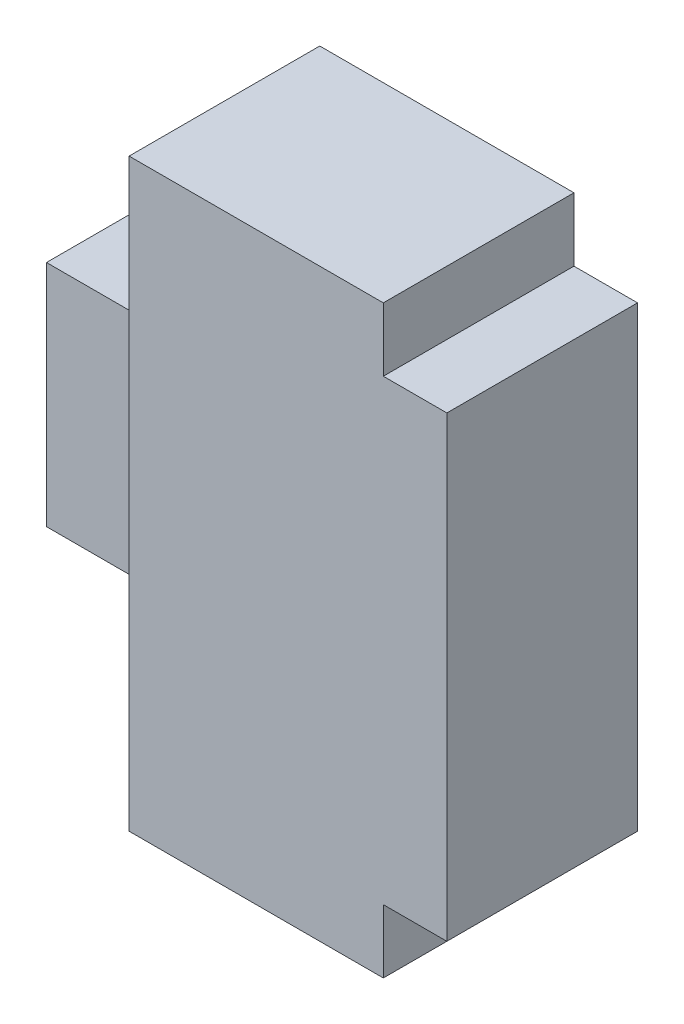
ISO-10303-21;
HEADER;
FILE_DESCRIPTION(('STEP AP214'),'2;1');
FILE_NAME('part.step','',(''),(''),'','','');
FILE_SCHEMA(('AUTOMOTIVE_DESIGN { 1 0 10303 214 1 1 1 1 }'));
ENDSEC;
DATA;
#1=APPLICATION_CONTEXT('core data for automotive mechanical design processes');
#2=APPLICATION_PROTOCOL_DEFINITION('international standard','automotive_design',2000,#1);
#3=PRODUCT_CONTEXT('',#1,'mechanical');
#4=PRODUCT('Part','Part','',(#3));
#5=PRODUCT_RELATED_PRODUCT_CATEGORY('part','',(#4));
#6=PRODUCT_DEFINITION_FORMATION('','',#4);
#7=PRODUCT_DEFINITION_CONTEXT('part definition',#1,'design');
#8=PRODUCT_DEFINITION('design','',#6,#7);
#9=PRODUCT_DEFINITION_SHAPE('','',#8);
#10=(LENGTH_UNIT() NAMED_UNIT(*) SI_UNIT(.MILLI.,.METRE.));
#11=(NAMED_UNIT(*) PLANE_ANGLE_UNIT() SI_UNIT($,.RADIAN.));
#12=(NAMED_UNIT(*) SI_UNIT($,.STERADIAN.) SOLID_ANGLE_UNIT());
#13=UNCERTAINTY_MEASURE_WITH_UNIT(LENGTH_MEASURE(1.E-05),#10,'distance_accuracy_value','');
#14=(GEOMETRIC_REPRESENTATION_CONTEXT(3) GLOBAL_UNCERTAINTY_ASSIGNED_CONTEXT((#13)) GLOBAL_UNIT_ASSIGNED_CONTEXT((#10,
#11,#12)) REPRESENTATION_CONTEXT('',''));
#15=CARTESIAN_POINT('',(0.,0.,0.));
#16=DIRECTION('',(0.,0.,1.));
#17=DIRECTION('',(1.,0.,0.));
#18=AXIS2_PLACEMENT_3D('',#15,#16,#17);
#19=CARTESIAN_POINT('',(-2.25,0.9,0.4));
#20=DIRECTION('',(-1.,0.,0.));
#21=DIRECTION('',(0.,0.,1.));
#22=AXIS2_PLACEMENT_3D('',#19,#20,#21);
#23=PLANE('',#22);
#24=DIRECTION('',(0.,0.,-1.));
#25=VECTOR('',#24,1.);
#26=CARTESIAN_POINT('',(-2.25,-0.9,0.4));
#27=LINE('',#26,#25);
#28=CARTESIAN_POINT('',(-2.25,-0.9,0.4));
#29=VERTEX_POINT('',#28);
#30=CARTESIAN_POINT('',(-2.25,-0.9,-0.4));
#31=VERTEX_POINT('',#30);
#32=EDGE_CURVE('E146',#29,#31,#27,.T.);
#33=ORIENTED_EDGE('',*,*,#32,.F.);
#34=DIRECTION('',(0.,1.,0.));
#35=VECTOR('',#34,1.);
#36=CARTESIAN_POINT('',(-2.25,0.9,0.4));
#37=LINE('',#36,#35);
#38=CARTESIAN_POINT('',(-2.25,0.9,0.4));
#39=VERTEX_POINT('',#38);
#40=EDGE_CURVE('E152',#39,#29,#37,.F.);
#41=ORIENTED_EDGE('',*,*,#40,.F.);
#42=DIRECTION('',(0.,0.,1.));
#43=VECTOR('',#42,1.);
#44=CARTESIAN_POINT('',(-2.25,0.9,0.4));
#45=LINE('',#44,#43);
#46=CARTESIAN_POINT('',(-2.25,0.9,-0.4));
#47=VERTEX_POINT('',#46);
#48=EDGE_CURVE('E20',#39,#47,#45,.F.);
#49=ORIENTED_EDGE('',*,*,#48,.T.);
#50=DIRECTION('',(0.,1.,0.));
#51=VECTOR('',#50,1.);
#52=CARTESIAN_POINT('',(-2.25,-0.9,-0.4));
#53=LINE('',#52,#51);
#54=EDGE_CURVE('E143',#31,#47,#53,.T.);
#55=ORIENTED_EDGE('',*,*,#54,.F.);
#56=EDGE_LOOP('',(#33,#41,#49,#55));
#57=FACE_BOUND('',#56,.T.);
#58=ADVANCED_FACE('F17',(#57),#23,.T.);
#59=CARTESIAN_POINT('',(0.75,1.8,-0.75));
#60=DIRECTION('',(-1.,0.,0.));
#61=DIRECTION('',(0.,0.,1.));
#62=AXIS2_PLACEMENT_3D('',#59,#60,#61);
#63=PLANE('',#62);
#64=DIRECTION('',(0.,0.,-1.));
#65=VECTOR('',#64,1.);
#66=CARTESIAN_POINT('',(0.75,2.3,-0.75));
#67=LINE('',#66,#65);
#68=CARTESIAN_POINT('',(0.75,2.3,-0.75));
#69=VERTEX_POINT('',#68);
#70=CARTESIAN_POINT('',(0.75,2.3,0.75));
#71=VERTEX_POINT('',#70);
#72=EDGE_CURVE('E164',#69,#71,#67,.F.);
#73=ORIENTED_EDGE('',*,*,#72,.T.);
#74=DIRECTION('',(0.,1.,0.));
#75=VECTOR('',#74,1.);
#76=CARTESIAN_POINT('',(0.75,2.3,0.75));
#77=LINE('',#76,#75);
#78=CARTESIAN_POINT('',(0.75,1.8,0.75));
#79=VERTEX_POINT('',#78);
#80=EDGE_CURVE('E121',#71,#79,#77,.F.);
#81=ORIENTED_EDGE('',*,*,#80,.T.);
#82=DIRECTION('',(0.,0.,-1.));
#83=VECTOR('',#82,1.);
#84=CARTESIAN_POINT('',(0.75,1.8,-0.75));
#85=LINE('',#84,#83);
#86=CARTESIAN_POINT('',(0.75,1.8,-0.75));
#87=VERTEX_POINT('',#86);
#88=EDGE_CURVE('E118',#79,#87,#85,.T.);
#89=ORIENTED_EDGE('',*,*,#88,.T.);
#90=DIRECTION('',(0.,1.,0.));
#91=VECTOR('',#90,1.);
#92=CARTESIAN_POINT('',(0.75,1.8,-0.75));
#93=LINE('',#92,#91);
#94=EDGE_CURVE('E107',#69,#87,#93,.F.);
#95=ORIENTED_EDGE('',*,*,#94,.F.);
#96=EDGE_LOOP('',(#73,#81,#89,#95));
#97=FACE_BOUND('',#96,.T.);
#98=ADVANCED_FACE('F119',(#97),#63,.F.);
#99=CARTESIAN_POINT('',(0.75,-1.8,-0.75));
#100=DIRECTION('',(0.,1.,0.));
#101=DIRECTION('',(0.,0.,1.));
#102=AXIS2_PLACEMENT_3D('',#99,#100,#101);
#103=PLANE('',#102);
#104=DIRECTION('',(0.,0.,1.));
#105=VECTOR('',#104,1.);
#106=CARTESIAN_POINT('',(1.25,-1.8,-0.75));
#107=LINE('',#106,#105);
#108=CARTESIAN_POINT('',(1.25,-1.8,-0.75));
#109=VERTEX_POINT('',#108);
#110=CARTESIAN_POINT('',(1.25,-1.8,0.75));
#111=VERTEX_POINT('',#110);
#112=EDGE_CURVE('E168',#109,#111,#107,.T.);
#113=ORIENTED_EDGE('',*,*,#112,.T.);
#114=DIRECTION('',(-1.,0.,0.));
#115=VECTOR('',#114,1.);
#116=CARTESIAN_POINT('',(-1.25,-1.8,0.75));
#117=LINE('',#116,#115);
#118=CARTESIAN_POINT('',(0.75,-1.8,0.75));
#119=VERTEX_POINT('',#118);
#120=EDGE_CURVE('E139',#111,#119,#117,.T.);
#121=ORIENTED_EDGE('',*,*,#120,.T.);
#122=DIRECTION('',(0.,0.,1.));
#123=VECTOR('',#122,1.);
#124=CARTESIAN_POINT('',(0.75,-1.8,-0.75));
#125=LINE('',#124,#123);
#126=CARTESIAN_POINT('',(0.75,-1.8,-0.75));
#127=VERTEX_POINT('',#126);
#128=EDGE_CURVE('E129',#119,#127,#125,.F.);
#129=ORIENTED_EDGE('',*,*,#128,.T.);
#130=DIRECTION('',(1.,0.,0.));
#131=VECTOR('',#130,1.);
#132=CARTESIAN_POINT('',(0.75,-1.8,-0.75));
#133=LINE('',#132,#131);
#134=EDGE_CURVE('E103',#109,#127,#133,.F.);
#135=ORIENTED_EDGE('',*,*,#134,.F.);
#136=EDGE_LOOP('',(#113,#121,#129,#135));
#137=FACE_BOUND('',#136,.T.);
#138=ADVANCED_FACE('F220',(#137),#103,.F.);
#139=CARTESIAN_POINT('',(1.25,1.8,-0.75));
#140=DIRECTION('',(0.,-1.,0.));
#141=DIRECTION('',(0.,0.,-1.));
#142=AXIS2_PLACEMENT_3D('',#139,#140,#141);
#143=PLANE('',#142);
#144=ORIENTED_EDGE('',*,*,#88,.F.);
#145=DIRECTION('',(-1.,0.,0.));
#146=VECTOR('',#145,1.);
#147=CARTESIAN_POINT('',(-1.25,1.8,0.75));
#148=LINE('',#147,#146);
#149=CARTESIAN_POINT('',(1.25,1.8,0.75));
#150=VERTEX_POINT('',#149);
#151=EDGE_CURVE('E137',#79,#150,#148,.F.);
#152=ORIENTED_EDGE('',*,*,#151,.T.);
#153=DIRECTION('',(0.,0.,1.));
#154=VECTOR('',#153,1.);
#155=CARTESIAN_POINT('',(1.25,1.8,-0.75));
#156=LINE('',#155,#154);
#157=CARTESIAN_POINT('',(1.25,1.8,-0.75));
#158=VERTEX_POINT('',#157);
#159=EDGE_CURVE('E127',#150,#158,#156,.F.);
#160=ORIENTED_EDGE('',*,*,#159,.T.);
#161=DIRECTION('',(1.,0.,0.));
#162=VECTOR('',#161,1.);
#163=CARTESIAN_POINT('',(1.25,1.8,-0.75));
#164=LINE('',#163,#162);
#165=EDGE_CURVE('E112',#87,#158,#164,.T.);
#166=ORIENTED_EDGE('',*,*,#165,.F.);
#167=EDGE_LOOP('',(#144,#152,#160,#166));
#168=FACE_BOUND('',#167,.T.);
#169=ADVANCED_FACE('F125',(#168),#143,.F.);
#170=CARTESIAN_POINT('',(0.75,-2.3,-0.75));
#171=DIRECTION('',(-1.,0.,0.));
#172=DIRECTION('',(0.,0.,1.));
#173=AXIS2_PLACEMENT_3D('',#170,#171,#172);
#174=PLANE('',#173);
#175=ORIENTED_EDGE('',*,*,#128,.F.);
#176=DIRECTION('',(0.,1.,0.));
#177=VECTOR('',#176,1.);
#178=CARTESIAN_POINT('',(0.75,2.3,0.75));
#179=LINE('',#178,#177);
#180=CARTESIAN_POINT('',(0.75,-2.3,0.75));
#181=VERTEX_POINT('',#180);
#182=EDGE_CURVE('E141',#119,#181,#179,.F.);
#183=ORIENTED_EDGE('',*,*,#182,.T.);
#184=DIRECTION('',(0.,0.,1.));
#185=VECTOR('',#184,1.);
#186=CARTESIAN_POINT('',(0.75,-2.3,-0.75));
#187=LINE('',#186,#185);
#188=CARTESIAN_POINT('',(0.75,-2.3,-0.75));
#189=VERTEX_POINT('',#188);
#190=EDGE_CURVE('E177',#181,#189,#187,.F.);
#191=ORIENTED_EDGE('',*,*,#190,.T.);
#192=DIRECTION('',(0.,1.,0.));
#193=VECTOR('',#192,1.);
#194=CARTESIAN_POINT('',(0.75,-2.3,-0.75));
#195=LINE('',#194,#193);
#196=EDGE_CURVE('E131',#127,#189,#195,.F.);
#197=ORIENTED_EDGE('',*,*,#196,.F.);
#198=EDGE_LOOP('',(#175,#183,#191,#197));
#199=FACE_BOUND('',#198,.T.);
#200=ADVANCED_FACE('F203',(#199),#174,.F.);
#201=CARTESIAN_POINT('',(-1.25,2.3,0.75));
#202=DIRECTION('',(0.,0.,-1.));
#203=DIRECTION('',(-1.,0.,0.));
#204=AXIS2_PLACEMENT_3D('',#201,#202,#203);
#205=PLANE('',#204);
#206=DIRECTION('',(1.,0.,0.));
#207=VECTOR('',#206,1.);
#208=CARTESIAN_POINT('',(-1.25,-2.3,0.75));
#209=LINE('',#208,#207);
#210=CARTESIAN_POINT('',(-1.25,-2.3,0.75));
#211=VERTEX_POINT('',#210);
#212=EDGE_CURVE('E174',#211,#181,#209,.T.);
#213=ORIENTED_EDGE('',*,*,#212,.T.);
#214=ORIENTED_EDGE('',*,*,#182,.F.);
#215=ORIENTED_EDGE('',*,*,#120,.F.);
#216=DIRECTION('',(0.,1.,0.));
#217=VECTOR('',#216,1.);
#218=CARTESIAN_POINT('',(1.25,-1.8,0.75));
#219=LINE('',#218,#217);
#220=EDGE_CURVE('E170',#111,#150,#219,.T.);
#221=ORIENTED_EDGE('',*,*,#220,.T.);
#222=ORIENTED_EDGE('',*,*,#151,.F.);
#223=ORIENTED_EDGE('',*,*,#80,.F.);
#224=DIRECTION('',(1.,0.,0.));
#225=VECTOR('',#224,1.);
#226=CARTESIAN_POINT('',(0.75,2.3,0.75));
#227=LINE('',#226,#225);
#228=CARTESIAN_POINT('',(-1.25,2.3,0.75));
#229=VERTEX_POINT('',#228);
#230=EDGE_CURVE('E166',#71,#229,#227,.F.);
#231=ORIENTED_EDGE('',*,*,#230,.T.);
#232=DIRECTION('',(0.,1.,0.));
#233=VECTOR('',#232,1.);
#234=CARTESIAN_POINT('',(-1.25,2.3,0.75));
#235=LINE('',#234,#233);
#236=EDGE_CURVE('E183',#229,#211,#235,.F.);
#237=ORIENTED_EDGE('',*,*,#236,.T.);
#238=EDGE_LOOP('',(#213,#214,#215,#221,#222,#223,#231,#237));
#239=FACE_BOUND('',#238,.T.);
#240=ADVANCED_FACE('F207',(#239),#205,.F.);
#241=CARTESIAN_POINT('',(-1.25,-0.9,-0.4));
#242=DIRECTION('',(0.,0.,-1.));
#243=DIRECTION('',(-1.,0.,0.));
#244=AXIS2_PLACEMENT_3D('',#241,#242,#243);
#245=PLANE('',#244);
#246=DIRECTION('',(1.,0.,0.));
#247=VECTOR('',#246,1.);
#248=CARTESIAN_POINT('',(-1.25,0.9,-0.4));
#249=LINE('',#248,#247);
#250=CARTESIAN_POINT('',(-1.25,0.9,-0.4));
#251=VERTEX_POINT('',#250);
#252=EDGE_CURVE('E158',#251,#47,#249,.F.);
#253=ORIENTED_EDGE('',*,*,#252,.F.);
#254=DIRECTION('',(0.,1.,0.));
#255=VECTOR('',#254,1.);
#256=CARTESIAN_POINT('',(-1.25,2.3,-0.4));
#257=LINE('',#256,#255);
#258=CARTESIAN_POINT('',(-1.25,-0.9,-0.4));
#259=VERTEX_POINT('',#258);
#260=EDGE_CURVE('E186',#251,#259,#257,.F.);
#261=ORIENTED_EDGE('',*,*,#260,.T.);
#262=DIRECTION('',(1.,0.,0.));
#263=VECTOR('',#262,1.);
#264=CARTESIAN_POINT('',(-1.25,-0.9,-0.4));
#265=LINE('',#264,#263);
#266=EDGE_CURVE('E149',#31,#259,#265,.T.);
#267=ORIENTED_EDGE('',*,*,#266,.F.);
#268=ORIENTED_EDGE('',*,*,#54,.T.);
#269=EDGE_LOOP('',(#253,#261,#267,#268));
#270=FACE_BOUND('',#269,.T.);
#271=ADVANCED_FACE('F254',(#270),#245,.T.);
#272=CARTESIAN_POINT('',(-1.25,-0.9,0.4));
#273=DIRECTION('',(0.,-1.,0.));
#274=DIRECTION('',(0.,0.,-1.));
#275=AXIS2_PLACEMENT_3D('',#272,#273,#274);
#276=PLANE('',#275);
#277=ORIENTED_EDGE('',*,*,#266,.T.);
#278=DIRECTION('',(0.,0.,-1.));
#279=VECTOR('',#278,1.);
#280=CARTESIAN_POINT('',(-1.25,-0.9,-0.75));
#281=LINE('',#280,#279);
#282=CARTESIAN_POINT('',(-1.25,-0.9,0.4));
#283=VERTEX_POINT('',#282);
#284=EDGE_CURVE('E188',#259,#283,#281,.F.);
#285=ORIENTED_EDGE('',*,*,#284,.T.);
#286=DIRECTION('',(1.,0.,0.));
#287=VECTOR('',#286,1.);
#288=CARTESIAN_POINT('',(-1.25,-0.9,0.4));
#289=LINE('',#288,#287);
#290=EDGE_CURVE('E155',#29,#283,#289,.T.);
#291=ORIENTED_EDGE('',*,*,#290,.F.);
#292=ORIENTED_EDGE('',*,*,#32,.T.);
#293=EDGE_LOOP('',(#277,#285,#291,#292));
#294=FACE_BOUND('',#293,.T.);
#295=ADVANCED_FACE('F250',(#294),#276,.T.);
#296=CARTESIAN_POINT('',(-1.25,0.9,0.4));
#297=DIRECTION('',(0.,0.,1.));
#298=DIRECTION('',(1.,0.,0.));
#299=AXIS2_PLACEMENT_3D('',#296,#297,#298);
#300=PLANE('',#299);
#301=ORIENTED_EDGE('',*,*,#290,.T.);
#302=DIRECTION('',(0.,1.,0.));
#303=VECTOR('',#302,1.);
#304=CARTESIAN_POINT('',(-1.25,2.3,0.4));
#305=LINE('',#304,#303);
#306=CARTESIAN_POINT('',(-1.25,0.9,0.4));
#307=VERTEX_POINT('',#306);
#308=EDGE_CURVE('E190',#283,#307,#305,.T.);
#309=ORIENTED_EDGE('',*,*,#308,.T.);
#310=DIRECTION('',(1.,0.,0.));
#311=VECTOR('',#310,1.);
#312=CARTESIAN_POINT('',(-1.25,0.9,0.4));
#313=LINE('',#312,#311);
#314=EDGE_CURVE('E161',#39,#307,#313,.T.);
#315=ORIENTED_EDGE('',*,*,#314,.F.);
#316=ORIENTED_EDGE('',*,*,#40,.T.);
#317=EDGE_LOOP('',(#301,#309,#315,#316));
#318=FACE_BOUND('',#317,.T.);
#319=ADVANCED_FACE('F246',(#318),#300,.T.);
#320=CARTESIAN_POINT('',(-1.25,0.9,-0.4));
#321=DIRECTION('',(0.,1.,0.));
#322=DIRECTION('',(0.,0.,1.));
#323=AXIS2_PLACEMENT_3D('',#320,#321,#322);
#324=PLANE('',#323);
#325=ORIENTED_EDGE('',*,*,#314,.T.);
#326=DIRECTION('',(0.,0.,-1.));
#327=VECTOR('',#326,1.);
#328=CARTESIAN_POINT('',(-1.25,0.9,-0.75));
#329=LINE('',#328,#327);
#330=EDGE_CURVE('E192',#307,#251,#329,.T.);
#331=ORIENTED_EDGE('',*,*,#330,.T.);
#332=ORIENTED_EDGE('',*,*,#252,.T.);
#333=ORIENTED_EDGE('',*,*,#48,.F.);
#334=EDGE_LOOP('',(#325,#331,#332,#333));
#335=FACE_BOUND('',#334,.T.);
#336=ADVANCED_FACE('F243',(#335),#324,.T.);
#337=CARTESIAN_POINT('',(0.75,2.3,-0.75));
#338=DIRECTION('',(0.,-1.,0.));
#339=DIRECTION('',(0.,0.,-1.));
#340=AXIS2_PLACEMENT_3D('',#337,#338,#339);
#341=PLANE('',#340);
#342=DIRECTION('',(0.,0.,-1.));
#343=VECTOR('',#342,1.);
#344=CARTESIAN_POINT('',(-1.25,2.3,-0.75));
#345=LINE('',#344,#343);
#346=CARTESIAN_POINT('',(-1.25,2.3,-0.75));
#347=VERTEX_POINT('',#346);
#348=EDGE_CURVE('E180',#347,#229,#345,.F.);
#349=ORIENTED_EDGE('',*,*,#348,.T.);
#350=ORIENTED_EDGE('',*,*,#230,.F.);
#351=ORIENTED_EDGE('',*,*,#72,.F.);
#352=DIRECTION('',(-1.,0.,0.));
#353=VECTOR('',#352,1.);
#354=CARTESIAN_POINT('',(-1.25,2.3,-0.75));
#355=LINE('',#354,#353);
#356=EDGE_CURVE('E114',#347,#69,#355,.F.);
#357=ORIENTED_EDGE('',*,*,#356,.F.);
#358=EDGE_LOOP('',(#349,#350,#351,#357));
#359=FACE_BOUND('',#358,.T.);
#360=ADVANCED_FACE('F214',(#359),#341,.F.);
#361=CARTESIAN_POINT('',(1.25,-1.8,-0.75));
#362=DIRECTION('',(-1.,0.,0.));
#363=DIRECTION('',(0.,0.,1.));
#364=AXIS2_PLACEMENT_3D('',#361,#362,#363);
#365=PLANE('',#364);
#366=ORIENTED_EDGE('',*,*,#159,.F.);
#367=ORIENTED_EDGE('',*,*,#220,.F.);
#368=ORIENTED_EDGE('',*,*,#112,.F.);
#369=DIRECTION('',(0.,1.,0.));
#370=VECTOR('',#369,1.);
#371=CARTESIAN_POINT('',(1.25,2.3,-0.75));
#372=LINE('',#371,#370);
#373=EDGE_CURVE('E196',#158,#109,#372,.F.);
#374=ORIENTED_EDGE('',*,*,#373,.F.);
#375=EDGE_LOOP('',(#366,#367,#368,#374));
#376=FACE_BOUND('',#375,.T.);
#377=ADVANCED_FACE('F218',(#376),#365,.F.);
#378=CARTESIAN_POINT('',(-1.25,-2.3,-0.75));
#379=DIRECTION('',(0.,1.,0.));
#380=DIRECTION('',(0.,0.,1.));
#381=AXIS2_PLACEMENT_3D('',#378,#379,#380);
#382=PLANE('',#381);
#383=ORIENTED_EDGE('',*,*,#190,.F.);
#384=ORIENTED_EDGE('',*,*,#212,.F.);
#385=DIRECTION('',(0.,0.,-1.));
#386=VECTOR('',#385,1.);
#387=CARTESIAN_POINT('',(-1.25,-2.3,-0.75));
#388=LINE('',#387,#386);
#389=CARTESIAN_POINT('',(-1.25,-2.3,-0.75));
#390=VERTEX_POINT('',#389);
#391=EDGE_CURVE('E35',#211,#390,#388,.T.);
#392=ORIENTED_EDGE('',*,*,#391,.T.);
#393=DIRECTION('',(-1.,0.,0.));
#394=VECTOR('',#393,1.);
#395=CARTESIAN_POINT('',(-1.25,-2.3,-0.75));
#396=LINE('',#395,#394);
#397=EDGE_CURVE('E26',#189,#390,#396,.T.);
#398=ORIENTED_EDGE('',*,*,#397,.F.);
#399=EDGE_LOOP('',(#383,#384,#392,#398));
#400=FACE_BOUND('',#399,.T.);
#401=ADVANCED_FACE('F200',(#400),#382,.F.);
#402=CARTESIAN_POINT('',(-1.25,2.3,-0.75));
#403=DIRECTION('',(1.,0.,0.));
#404=DIRECTION('',(0.,0.,-1.));
#405=AXIS2_PLACEMENT_3D('',#402,#403,#404);
#406=PLANE('',#405);
#407=ORIENTED_EDGE('',*,*,#308,.F.);
#408=ORIENTED_EDGE('',*,*,#284,.F.);
#409=ORIENTED_EDGE('',*,*,#260,.F.);
#410=ORIENTED_EDGE('',*,*,#330,.F.);
#411=EDGE_LOOP('',(#407,#408,#409,#410));
#412=FACE_BOUND('',#411,.T.);
#413=ORIENTED_EDGE('',*,*,#391,.F.);
#414=ORIENTED_EDGE('',*,*,#236,.F.);
#415=ORIENTED_EDGE('',*,*,#348,.F.);
#416=DIRECTION('',(0.,1.,0.));
#417=VECTOR('',#416,1.);
#418=CARTESIAN_POINT('',(-1.25,2.3,-0.75));
#419=LINE('',#418,#417);
#420=EDGE_CURVE('E11',#390,#347,#419,.T.);
#421=ORIENTED_EDGE('',*,*,#420,.F.);
#422=EDGE_LOOP('',(#413,#414,#415,#421));
#423=FACE_BOUND('',#422,.T.);
#424=ADVANCED_FACE('F212',(#412,#423),#406,.F.);
#425=CARTESIAN_POINT('',(-1.25,2.3,-0.75));
#426=DIRECTION('',(0.,0.,-1.));
#427=DIRECTION('',(-1.,0.,0.));
#428=AXIS2_PLACEMENT_3D('',#425,#426,#427);
#429=PLANE('',#428);
#430=ORIENTED_EDGE('',*,*,#397,.T.);
#431=ORIENTED_EDGE('',*,*,#420,.T.);
#432=ORIENTED_EDGE('',*,*,#356,.T.);
#433=ORIENTED_EDGE('',*,*,#94,.T.);
#434=ORIENTED_EDGE('',*,*,#165,.T.);
#435=ORIENTED_EDGE('',*,*,#373,.T.);
#436=ORIENTED_EDGE('',*,*,#134,.T.);
#437=ORIENTED_EDGE('',*,*,#196,.T.);
#438=EDGE_LOOP('',(#430,#431,#432,#433,#434,#435,#436,#437));
#439=FACE_BOUND('',#438,.T.);
#440=ADVANCED_FACE('F110',(#439),#429,.T.);
#441=CLOSED_SHELL('',(#58,#98,#138,#169,#200,#240,#271,#295,#319,#336,#360,#377,#401,#424,#440));
#442=MANIFOLD_SOLID_BREP('B1',#441);
#443=ADVANCED_BREP_SHAPE_REPRESENTATION('',(#18,#442),#14);
#444=SHAPE_DEFINITION_REPRESENTATION(#9,#443);
ENDSEC;
END-ISO-10303-21;
